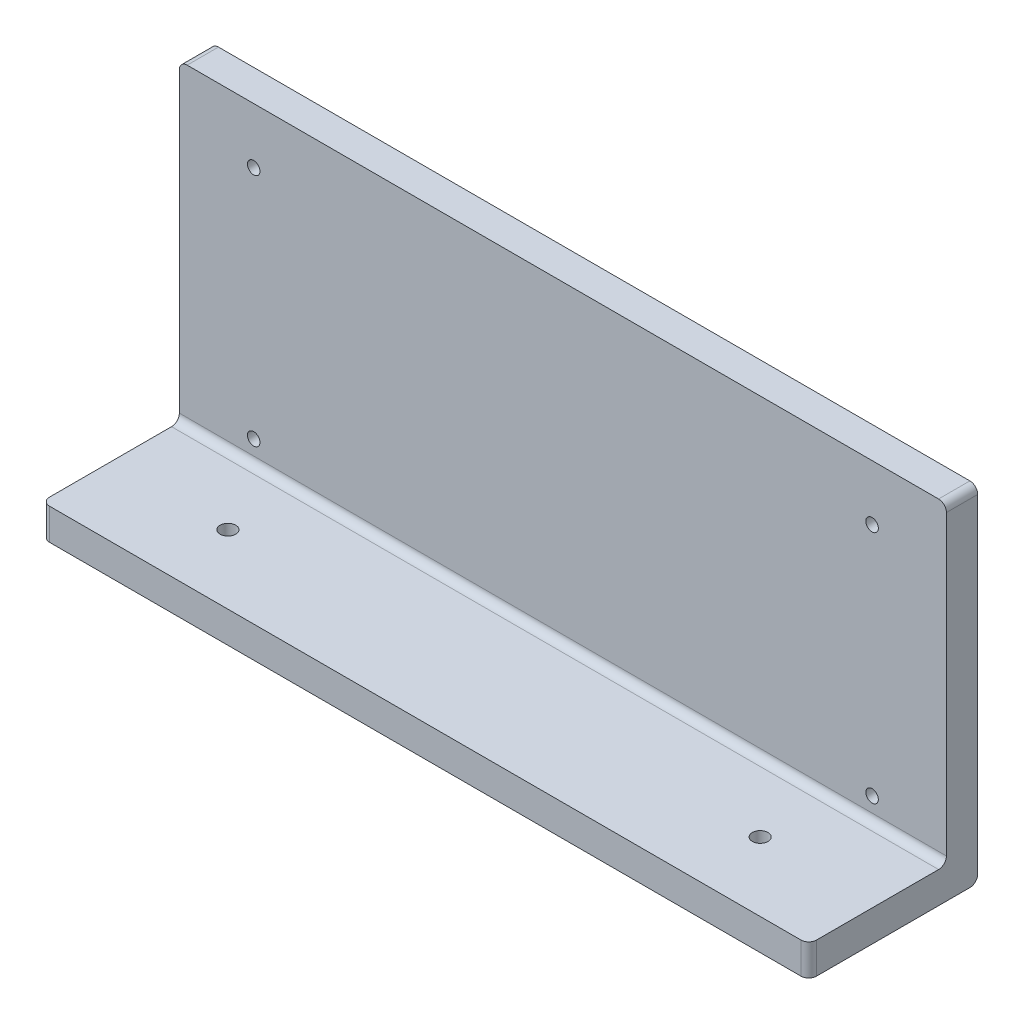
ISO-10303-21;
HEADER;
FILE_DESCRIPTION(('STEP AP214'),'2;1');
FILE_NAME('part.step','',(''),(''),'','','');
FILE_SCHEMA(('AUTOMOTIVE_DESIGN { 1 0 10303 214 1 1 1 1 }'));
ENDSEC;
DATA;
#1=APPLICATION_CONTEXT('core data for automotive mechanical design processes');
#2=APPLICATION_PROTOCOL_DEFINITION('international standard','automotive_design',2000,#1);
#3=PRODUCT_CONTEXT('',#1,'mechanical');
#4=PRODUCT('Part','Part','',(#3));
#5=PRODUCT_RELATED_PRODUCT_CATEGORY('part','',(#4));
#6=PRODUCT_DEFINITION_FORMATION('','',#4);
#7=PRODUCT_DEFINITION_CONTEXT('part definition',#1,'design');
#8=PRODUCT_DEFINITION('design','',#6,#7);
#9=PRODUCT_DEFINITION_SHAPE('','',#8);
#10=(LENGTH_UNIT() NAMED_UNIT(*) SI_UNIT(.MILLI.,.METRE.));
#11=(NAMED_UNIT(*) PLANE_ANGLE_UNIT() SI_UNIT($,.RADIAN.));
#12=(NAMED_UNIT(*) SI_UNIT($,.STERADIAN.) SOLID_ANGLE_UNIT());
#13=UNCERTAINTY_MEASURE_WITH_UNIT(LENGTH_MEASURE(1.E-05),#10,'distance_accuracy_value','');
#14=(GEOMETRIC_REPRESENTATION_CONTEXT(3) GLOBAL_UNCERTAINTY_ASSIGNED_CONTEXT((#13)) GLOBAL_UNIT_ASSIGNED_CONTEXT((#10,
#11,#12)) REPRESENTATION_CONTEXT('',''));
#15=CARTESIAN_POINT('',(0.,0.,0.));
#16=DIRECTION('',(0.,0.,1.));
#17=DIRECTION('',(1.,0.,0.));
#18=AXIS2_PLACEMENT_3D('',#15,#16,#17);
#19=CARTESIAN_POINT('',(0.,4.,0.));
#20=DIRECTION('',(0.,-1.,0.));
#21=DIRECTION('',(0.,0.,-1.));
#22=AXIS2_PLACEMENT_3D('',#19,#20,#21);
#23=PLANE('',#22);
#24=CARTESIAN_POINT('',(-34.,4.,2.));
#25=DIRECTION('',(0.,1.,0.));
#26=DIRECTION('',(0.,0.,1.));
#27=AXIS2_PLACEMENT_3D('',#24,#25,#26);
#28=CIRCLE('',#27,0.999999999999998);
#29=CARTESIAN_POINT('',(-34.,4.,3.));
#30=VERTEX_POINT('',#29);
#31=EDGE_CURVE('E270',#30,#30,#28,.T.);
#32=ORIENTED_EDGE('',*,*,#31,.F.);
#33=EDGE_LOOP('',(#32));
#34=FACE_BOUND('',#33,.T.);
#35=CARTESIAN_POINT('',(34.,4.,2.));
#36=DIRECTION('',(0.,1.,0.));
#37=DIRECTION('',(0.,0.,-1.));
#38=AXIS2_PLACEMENT_3D('',#35,#36,#37);
#39=CIRCLE('',#38,0.999999999999998);
#40=CARTESIAN_POINT('',(34.,4.,1.));
#41=VERTEX_POINT('',#40);
#42=EDGE_CURVE('E278',#41,#41,#39,.T.);
#43=ORIENTED_EDGE('',*,*,#42,.F.);
#44=EDGE_LOOP('',(#43));
#45=FACE_BOUND('',#44,.T.);
#46=DIRECTION('',(1.,0.,0.));
#47=VECTOR('',#46,1.);
#48=CARTESIAN_POINT('',(-49.,4.,10.795));
#49=LINE('',#48,#47);
#50=CARTESIAN_POINT('',(-48.,4.,10.795));
#51=VERTEX_POINT('',#50);
#52=CARTESIAN_POINT('',(48.,4.,10.795));
#53=VERTEX_POINT('',#52);
#54=EDGE_CURVE('E190',#51,#53,#49,.T.);
#55=ORIENTED_EDGE('',*,*,#54,.T.);
#56=CARTESIAN_POINT('',(48.,4.,9.795));
#57=DIRECTION('',(0.,-1.,0.));
#58=DIRECTION('',(0.,0.,-1.));
#59=AXIS2_PLACEMENT_3D('',#56,#57,#58);
#60=CIRCLE('',#59,1.);
#61=CARTESIAN_POINT('',(49.,4.,9.795));
#62=VERTEX_POINT('',#61);
#63=EDGE_CURVE('E263',#53,#62,#60,.F.);
#64=ORIENTED_EDGE('',*,*,#63,.T.);
#65=DIRECTION('',(0.,0.,-1.));
#66=VECTOR('',#65,1.);
#67=CARTESIAN_POINT('',(49.,4.,10.795));
#68=LINE('',#67,#66);
#69=CARTESIAN_POINT('',(49.,4.,-5.795));
#70=VERTEX_POINT('',#69);
#71=EDGE_CURVE('E182',#62,#70,#68,.T.);
#72=ORIENTED_EDGE('',*,*,#71,.T.);
#73=DIRECTION('',(1.,0.,0.));
#74=VECTOR('',#73,1.);
#75=CARTESIAN_POINT('',(-49.,4.,-5.79499999999999));
#76=LINE('',#75,#74);
#77=CARTESIAN_POINT('',(-49.,4.,-5.79499999999999));
#78=VERTEX_POINT('',#77);
#79=EDGE_CURVE('E258',#70,#78,#76,.F.);
#80=ORIENTED_EDGE('',*,*,#79,.T.);
#81=DIRECTION('',(0.,0.,1.));
#82=VECTOR('',#81,1.);
#83=CARTESIAN_POINT('',(-49.,4.,10.795));
#84=LINE('',#83,#82);
#85=CARTESIAN_POINT('',(-49.,4.,9.795));
#86=VERTEX_POINT('',#85);
#87=EDGE_CURVE('E186',#78,#86,#84,.T.);
#88=ORIENTED_EDGE('',*,*,#87,.T.);
#89=CARTESIAN_POINT('',(-48.,4.,9.795));
#90=DIRECTION('',(0.,-1.,0.));
#91=DIRECTION('',(0.,0.,-1.));
#92=AXIS2_PLACEMENT_3D('',#89,#90,#91);
#93=CIRCLE('',#92,1.);
#94=EDGE_CURVE('E64',#86,#51,#93,.F.);
#95=ORIENTED_EDGE('',*,*,#94,.T.);
#96=EDGE_LOOP('',(#55,#64,#72,#80,#88,#95));
#97=FACE_BOUND('',#96,.T.);
#98=ADVANCED_FACE('F39',(#34,#45,#97),#23,.F.);
#99=CARTESIAN_POINT('',(49.,4.,10.795));
#100=DIRECTION('',(-1.,0.,0.));
#101=DIRECTION('',(0.,0.,1.));
#102=AXIS2_PLACEMENT_3D('',#99,#100,#101);
#103=PLANE('',#102);
#104=DIRECTION('',(0.,-1.,0.));
#105=VECTOR('',#104,1.);
#106=CARTESIAN_POINT('',(49.,4.,-10.795));
#107=LINE('',#106,#105);
#108=CARTESIAN_POINT('',(49.,43.,-10.795));
#109=VERTEX_POINT('',#108);
#110=CARTESIAN_POINT('',(49.,1.,-10.795));
#111=VERTEX_POINT('',#110);
#112=EDGE_CURVE('E157',#109,#111,#107,.T.);
#113=ORIENTED_EDGE('',*,*,#112,.F.);
#114=DIRECTION('',(0.,0.,-1.));
#115=VECTOR('',#114,1.);
#116=CARTESIAN_POINT('',(49.,43.,10.795));
#117=LINE('',#116,#115);
#118=CARTESIAN_POINT('',(49.,43.,-6.795));
#119=VERTEX_POINT('',#118);
#120=EDGE_CURVE('E137',#109,#119,#117,.F.);
#121=ORIENTED_EDGE('',*,*,#120,.T.);
#122=DIRECTION('',(0.,-1.,0.));
#123=VECTOR('',#122,1.);
#124=CARTESIAN_POINT('',(49.,44.,-6.795));
#125=LINE('',#124,#123);
#126=CARTESIAN_POINT('',(49.,5.,-6.795));
#127=VERTEX_POINT('',#126);
#128=EDGE_CURVE('E167',#119,#127,#125,.T.);
#129=ORIENTED_EDGE('',*,*,#128,.T.);
#130=CARTESIAN_POINT('',(49.,5.,-5.795));
#131=DIRECTION('',(-1.,0.,0.));
#132=DIRECTION('',(0.,0.,1.));
#133=AXIS2_PLACEMENT_3D('',#130,#131,#132);
#134=CIRCLE('',#133,1.);
#135=EDGE_CURVE('E49',#127,#70,#134,.T.);
#136=ORIENTED_EDGE('',*,*,#135,.T.);
#137=ORIENTED_EDGE('',*,*,#71,.F.);
#138=DIRECTION('',(0.,-1.,0.));
#139=VECTOR('',#138,1.);
#140=CARTESIAN_POINT('',(49.,4.,9.795));
#141=LINE('',#140,#139);
#142=CARTESIAN_POINT('',(49.,0.,9.795));
#143=VERTEX_POINT('',#142);
#144=EDGE_CURVE('E237',#62,#143,#141,.T.);
#145=ORIENTED_EDGE('',*,*,#144,.T.);
#146=DIRECTION('',(0.,0.,-1.));
#147=VECTOR('',#146,1.);
#148=CARTESIAN_POINT('',(49.,0.,10.795));
#149=LINE('',#148,#147);
#150=CARTESIAN_POINT('',(49.,0.,-9.795));
#151=VERTEX_POINT('',#150);
#152=EDGE_CURVE('E181',#143,#151,#149,.T.);
#153=ORIENTED_EDGE('',*,*,#152,.T.);
#154=CARTESIAN_POINT('',(49.,1.,-9.795));
#155=DIRECTION('',(-1.,0.,0.));
#156=DIRECTION('',(0.,0.,1.));
#157=AXIS2_PLACEMENT_3D('',#154,#155,#156);
#158=CIRCLE('',#157,1.);
#159=EDGE_CURVE('E234',#151,#111,#158,.F.);
#160=ORIENTED_EDGE('',*,*,#159,.T.);
#161=EDGE_LOOP('',(#113,#121,#129,#136,#137,#145,#153,#160));
#162=FACE_BOUND('',#161,.T.);
#163=ADVANCED_FACE('F331',(#162),#103,.F.);
#164=CARTESIAN_POINT('',(-49.,4.,-10.795));
#165=DIRECTION('',(0.,0.,1.));
#166=DIRECTION('',(1.,0.,0.));
#167=AXIS2_PLACEMENT_3D('',#164,#165,#166);
#168=PLANE('',#167);
#169=CARTESIAN_POINT('',(39.5000000000002,6.90405139141699,-10.795));
#170=DIRECTION('',(0.,0.,1.));
#171=DIRECTION('',(1.,0.,0.));
#172=AXIS2_PLACEMENT_3D('',#169,#170,#171);
#173=CIRCLE('',#172,0.799999999999985);
#174=CARTESIAN_POINT('',(40.3000000000002,6.90405139141699,-10.795));
#175=VERTEX_POINT('',#174);
#176=EDGE_CURVE('E163',#175,#175,#173,.T.);
#177=ORIENTED_EDGE('',*,*,#176,.T.);
#178=EDGE_LOOP('',(#177));
#179=FACE_BOUND('',#178,.T.);
#180=CARTESIAN_POINT('',(39.4999999999999,36.904051391417,-10.795));
#181=DIRECTION('',(0.,0.,1.));
#182=DIRECTION('',(1.,0.,0.));
#183=AXIS2_PLACEMENT_3D('',#180,#181,#182);
#184=CIRCLE('',#183,0.799999999999985);
#185=CARTESIAN_POINT('',(40.2999999999999,36.904051391417,-10.795));
#186=VERTEX_POINT('',#185);
#187=EDGE_CURVE('E170',#186,#186,#184,.T.);
#188=ORIENTED_EDGE('',*,*,#187,.T.);
#189=EDGE_LOOP('',(#188));
#190=FACE_BOUND('',#189,.T.);
#191=CARTESIAN_POINT('',(-39.5000000000002,36.9040513914162,-10.795));
#192=DIRECTION('',(0.,0.,1.));
#193=DIRECTION('',(1.,0.,0.));
#194=AXIS2_PLACEMENT_3D('',#191,#192,#193);
#195=CIRCLE('',#194,0.800000000000016);
#196=CARTESIAN_POINT('',(-38.7000000000002,36.9040513914162,-10.795));
#197=VERTEX_POINT('',#196);
#198=EDGE_CURVE('E305',#197,#197,#195,.T.);
#199=ORIENTED_EDGE('',*,*,#198,.T.);
#200=EDGE_LOOP('',(#199));
#201=FACE_BOUND('',#200,.T.);
#202=CARTESIAN_POINT('',(-39.4999999999999,6.90405139141616,-10.795));
#203=DIRECTION('',(0.,0.,1.));
#204=DIRECTION('',(1.,0.,0.));
#205=AXIS2_PLACEMENT_3D('',#202,#203,#204);
#206=CIRCLE('',#205,0.799999999999983);
#207=CARTESIAN_POINT('',(-38.6999999999999,6.90405139141616,-10.795));
#208=VERTEX_POINT('',#207);
#209=EDGE_CURVE('E301',#208,#208,#206,.T.);
#210=ORIENTED_EDGE('',*,*,#209,.T.);
#211=EDGE_LOOP('',(#210));
#212=FACE_BOUND('',#211,.T.);
#213=DIRECTION('',(0.,-1.,0.));
#214=VECTOR('',#213,1.);
#215=CARTESIAN_POINT('',(-49.,4.,-10.795));
#216=LINE('',#215,#214);
#217=CARTESIAN_POINT('',(-49.,43.,-10.795));
#218=VERTEX_POINT('',#217);
#219=CARTESIAN_POINT('',(-49.,1.,-10.795));
#220=VERTEX_POINT('',#219);
#221=EDGE_CURVE('E193',#218,#220,#216,.T.);
#222=ORIENTED_EDGE('',*,*,#221,.F.);
#223=CARTESIAN_POINT('',(-48.,43.,-10.795));
#224=DIRECTION('',(0.,0.,1.));
#225=DIRECTION('',(1.,0.,0.));
#226=AXIS2_PLACEMENT_3D('',#223,#224,#225);
#227=CIRCLE('',#226,1.);
#228=CARTESIAN_POINT('',(-48.,44.,-10.795));
#229=VERTEX_POINT('',#228);
#230=EDGE_CURVE('E143',#218,#229,#227,.F.);
#231=ORIENTED_EDGE('',*,*,#230,.T.);
#232=DIRECTION('',(-1.,0.,0.));
#233=VECTOR('',#232,1.);
#234=CARTESIAN_POINT('',(49.,44.,-10.795));
#235=LINE('',#234,#233);
#236=CARTESIAN_POINT('',(48.,44.,-10.795));
#237=VERTEX_POINT('',#236);
#238=EDGE_CURVE('E151',#237,#229,#235,.T.);
#239=ORIENTED_EDGE('',*,*,#238,.F.);
#240=CARTESIAN_POINT('',(48.,43.,-10.795));
#241=DIRECTION('',(0.,0.,1.));
#242=DIRECTION('',(1.,0.,0.));
#243=AXIS2_PLACEMENT_3D('',#240,#241,#242);
#244=CIRCLE('',#243,1.);
#245=EDGE_CURVE('E132',#237,#109,#244,.F.);
#246=ORIENTED_EDGE('',*,*,#245,.T.);
#247=ORIENTED_EDGE('',*,*,#112,.T.);
#248=DIRECTION('',(-1.,0.,0.));
#249=VECTOR('',#248,1.);
#250=CARTESIAN_POINT('',(-49.,1.,-10.795));
#251=LINE('',#250,#249);
#252=EDGE_CURVE('E144',#111,#220,#251,.T.);
#253=ORIENTED_EDGE('',*,*,#252,.T.);
#254=EDGE_LOOP('',(#222,#231,#239,#246,#247,#253));
#255=FACE_BOUND('',#254,.T.);
#256=ADVANCED_FACE('F160',(#179,#190,#201,#212,#255),#168,.F.);
#257=CARTESIAN_POINT('',(-49.,4.,10.795));
#258=DIRECTION('',(1.,0.,0.));
#259=DIRECTION('',(0.,0.,-1.));
#260=AXIS2_PLACEMENT_3D('',#257,#258,#259);
#261=PLANE('',#260);
#262=DIRECTION('',(0.,-1.,0.));
#263=VECTOR('',#262,1.);
#264=CARTESIAN_POINT('',(-49.,44.,-6.79499999999999));
#265=LINE('',#264,#263);
#266=CARTESIAN_POINT('',(-49.,43.,-6.79499999999999));
#267=VERTEX_POINT('',#266);
#268=CARTESIAN_POINT('',(-49.,5.,-6.79499999999999));
#269=VERTEX_POINT('',#268);
#270=EDGE_CURVE('E177',#267,#269,#265,.T.);
#271=ORIENTED_EDGE('',*,*,#270,.F.);
#272=DIRECTION('',(0.,0.,1.));
#273=VECTOR('',#272,1.);
#274=CARTESIAN_POINT('',(-49.,43.,10.795));
#275=LINE('',#274,#273);
#276=EDGE_CURVE('E226',#267,#218,#275,.F.);
#277=ORIENTED_EDGE('',*,*,#276,.T.);
#278=ORIENTED_EDGE('',*,*,#221,.T.);
#279=CARTESIAN_POINT('',(-49.,1.,-9.795));
#280=DIRECTION('',(1.,0.,0.));
#281=DIRECTION('',(0.,0.,-1.));
#282=AXIS2_PLACEMENT_3D('',#279,#280,#281);
#283=CIRCLE('',#282,1.);
#284=CARTESIAN_POINT('',(-49.,0.,-9.795));
#285=VERTEX_POINT('',#284);
#286=EDGE_CURVE('E220',#220,#285,#283,.F.);
#287=ORIENTED_EDGE('',*,*,#286,.T.);
#288=DIRECTION('',(0.,0.,1.));
#289=VECTOR('',#288,1.);
#290=CARTESIAN_POINT('',(-49.,0.,10.795));
#291=LINE('',#290,#289);
#292=CARTESIAN_POINT('',(-49.,0.,9.795));
#293=VERTEX_POINT('',#292);
#294=EDGE_CURVE('E197',#285,#293,#291,.T.);
#295=ORIENTED_EDGE('',*,*,#294,.T.);
#296=DIRECTION('',(0.,-1.,0.));
#297=VECTOR('',#296,1.);
#298=CARTESIAN_POINT('',(-49.,4.,9.795));
#299=LINE('',#298,#297);
#300=EDGE_CURVE('E223',#293,#86,#299,.F.);
#301=ORIENTED_EDGE('',*,*,#300,.T.);
#302=ORIENTED_EDGE('',*,*,#87,.F.);
#303=CARTESIAN_POINT('',(-49.,5.,-5.79499999999999));
#304=DIRECTION('',(1.,0.,0.));
#305=DIRECTION('',(0.,0.,-1.));
#306=AXIS2_PLACEMENT_3D('',#303,#304,#305);
#307=CIRCLE('',#306,1.);
#308=EDGE_CURVE('E11',#78,#269,#307,.T.);
#309=ORIENTED_EDGE('',*,*,#308,.T.);
#310=EDGE_LOOP('',(#271,#277,#278,#287,#295,#301,#302,#309));
#311=FACE_BOUND('',#310,.T.);
#312=ADVANCED_FACE('F351',(#311),#261,.F.);
#313=CARTESIAN_POINT('',(-49.,4.,10.795));
#314=DIRECTION('',(0.,0.,-1.));
#315=DIRECTION('',(-1.,0.,0.));
#316=AXIS2_PLACEMENT_3D('',#313,#314,#315);
#317=PLANE('',#316);
#318=DIRECTION('',(1.,0.,0.));
#319=VECTOR('',#318,1.);
#320=CARTESIAN_POINT('',(-49.,0.,10.795));
#321=LINE('',#320,#319);
#322=CARTESIAN_POINT('',(-48.,0.,10.795));
#323=VERTEX_POINT('',#322);
#324=CARTESIAN_POINT('',(48.,0.,10.795));
#325=VERTEX_POINT('',#324);
#326=EDGE_CURVE('E187',#323,#325,#321,.T.);
#327=ORIENTED_EDGE('',*,*,#326,.T.);
#328=DIRECTION('',(0.,-1.,0.));
#329=VECTOR('',#328,1.);
#330=CARTESIAN_POINT('',(48.,4.,10.795));
#331=LINE('',#330,#329);
#332=EDGE_CURVE('E57',#325,#53,#331,.F.);
#333=ORIENTED_EDGE('',*,*,#332,.T.);
#334=ORIENTED_EDGE('',*,*,#54,.F.);
#335=DIRECTION('',(0.,-1.,0.));
#336=VECTOR('',#335,1.);
#337=CARTESIAN_POINT('',(-48.,4.,10.795));
#338=LINE('',#337,#336);
#339=EDGE_CURVE('E252',#51,#323,#338,.T.);
#340=ORIENTED_EDGE('',*,*,#339,.T.);
#341=EDGE_LOOP('',(#327,#333,#334,#340));
#342=FACE_BOUND('',#341,.T.);
#343=ADVANCED_FACE('F347',(#342),#317,.F.);
#344=CARTESIAN_POINT('',(0.,0.,0.));
#345=DIRECTION('',(0.,-1.,0.));
#346=DIRECTION('',(0.,0.,-1.));
#347=AXIS2_PLACEMENT_3D('',#344,#345,#346);
#348=PLANE('',#347);
#349=CARTESIAN_POINT('',(-34.,0.,2.));
#350=DIRECTION('',(0.,-1.,0.));
#351=DIRECTION('',(0.,0.,-1.));
#352=AXIS2_PLACEMENT_3D('',#349,#350,#351);
#353=CIRCLE('',#352,0.999999999999998);
#354=CARTESIAN_POINT('',(-34.,0.,1.));
#355=VERTEX_POINT('',#354);
#356=EDGE_CURVE('E43',#355,#355,#353,.T.);
#357=ORIENTED_EDGE('',*,*,#356,.F.);
#358=EDGE_LOOP('',(#357));
#359=FACE_BOUND('',#358,.T.);
#360=CARTESIAN_POINT('',(34.,0.,2.));
#361=DIRECTION('',(0.,-1.,0.));
#362=DIRECTION('',(0.,0.,-1.));
#363=AXIS2_PLACEMENT_3D('',#360,#361,#362);
#364=CIRCLE('',#363,0.999999999999998);
#365=CARTESIAN_POINT('',(34.,0.,1.));
#366=VERTEX_POINT('',#365);
#367=EDGE_CURVE('E267',#366,#366,#364,.T.);
#368=ORIENTED_EDGE('',*,*,#367,.F.);
#369=EDGE_LOOP('',(#368));
#370=FACE_BOUND('',#369,.T.);
#371=ORIENTED_EDGE('',*,*,#152,.F.);
#372=CARTESIAN_POINT('',(48.,0.,9.795));
#373=DIRECTION('',(0.,-1.,0.));
#374=DIRECTION('',(0.,0.,-1.));
#375=AXIS2_PLACEMENT_3D('',#372,#373,#374);
#376=CIRCLE('',#375,1.);
#377=EDGE_CURVE('E249',#143,#325,#376,.T.);
#378=ORIENTED_EDGE('',*,*,#377,.T.);
#379=ORIENTED_EDGE('',*,*,#326,.F.);
#380=CARTESIAN_POINT('',(-48.,0.,9.795));
#381=DIRECTION('',(0.,-1.,0.));
#382=DIRECTION('',(0.,0.,-1.));
#383=AXIS2_PLACEMENT_3D('',#380,#381,#382);
#384=CIRCLE('',#383,1.);
#385=EDGE_CURVE('E246',#323,#293,#384,.T.);
#386=ORIENTED_EDGE('',*,*,#385,.T.);
#387=ORIENTED_EDGE('',*,*,#294,.F.);
#388=DIRECTION('',(-1.,0.,0.));
#389=VECTOR('',#388,1.);
#390=CARTESIAN_POINT('',(49.,0.,-9.795));
#391=LINE('',#390,#389);
#392=EDGE_CURVE('E243',#285,#151,#391,.F.);
#393=ORIENTED_EDGE('',*,*,#392,.T.);
#394=EDGE_LOOP('',(#371,#378,#379,#386,#387,#393));
#395=FACE_BOUND('',#394,.T.);
#396=ADVANCED_FACE('F344',(#359,#370,#395),#348,.T.);
#397=CARTESIAN_POINT('',(49.,44.,-6.795));
#398=DIRECTION('',(0.,0.,-1.));
#399=DIRECTION('',(-1.,0.,0.));
#400=AXIS2_PLACEMENT_3D('',#397,#398,#399);
#401=PLANE('',#400);
#402=CARTESIAN_POINT('',(39.5000000000002,6.90405139141699,-6.79499999999999));
#403=DIRECTION('',(0.,0.,1.));
#404=DIRECTION('',(1.,0.,0.));
#405=AXIS2_PLACEMENT_3D('',#402,#403,#404);
#406=CIRCLE('',#405,0.799999999999985);
#407=CARTESIAN_POINT('',(40.3000000000002,6.90405139141699,-6.79499999999999));
#408=VERTEX_POINT('',#407);
#409=EDGE_CURVE('E276',#408,#408,#406,.T.);
#410=ORIENTED_EDGE('',*,*,#409,.F.);
#411=EDGE_LOOP('',(#410));
#412=FACE_BOUND('',#411,.T.);
#413=CARTESIAN_POINT('',(39.4999999999999,36.904051391417,-6.79499999999999));
#414=DIRECTION('',(0.,0.,1.));
#415=DIRECTION('',(1.,0.,0.));
#416=AXIS2_PLACEMENT_3D('',#413,#414,#415);
#417=CIRCLE('',#416,0.799999999999985);
#418=CARTESIAN_POINT('',(40.2999999999999,36.904051391417,-6.79499999999999));
#419=VERTEX_POINT('',#418);
#420=EDGE_CURVE('E291',#419,#419,#417,.T.);
#421=ORIENTED_EDGE('',*,*,#420,.F.);
#422=EDGE_LOOP('',(#421));
#423=FACE_BOUND('',#422,.T.);
#424=CARTESIAN_POINT('',(-39.5000000000002,36.9040513914162,-6.79499999999999));
#425=DIRECTION('',(0.,0.,1.));
#426=DIRECTION('',(1.,0.,0.));
#427=AXIS2_PLACEMENT_3D('',#424,#425,#426);
#428=CIRCLE('',#427,0.800000000000016);
#429=CARTESIAN_POINT('',(-38.7000000000002,36.9040513914162,-6.79499999999999));
#430=VERTEX_POINT('',#429);
#431=EDGE_CURVE('E286',#430,#430,#428,.T.);
#432=ORIENTED_EDGE('',*,*,#431,.F.);
#433=EDGE_LOOP('',(#432));
#434=FACE_BOUND('',#433,.T.);
#435=CARTESIAN_POINT('',(-39.4999999999999,6.90405139141616,-6.79499999999999));
#436=DIRECTION('',(0.,0.,1.));
#437=DIRECTION('',(1.,0.,0.));
#438=AXIS2_PLACEMENT_3D('',#435,#436,#437);
#439=CIRCLE('',#438,0.799999999999983);
#440=CARTESIAN_POINT('',(-38.6999999999999,6.90405139141616,-6.79499999999999));
#441=VERTEX_POINT('',#440);
#442=EDGE_CURVE('E290',#441,#441,#439,.T.);
#443=ORIENTED_EDGE('',*,*,#442,.F.);
#444=EDGE_LOOP('',(#443));
#445=FACE_BOUND('',#444,.T.);
#446=DIRECTION('',(1.,0.,0.));
#447=VECTOR('',#446,1.);
#448=CARTESIAN_POINT('',(49.,44.,-6.795));
#449=LINE('',#448,#447);
#450=CARTESIAN_POINT('',(-48.,44.,-6.79499999999999));
#451=VERTEX_POINT('',#450);
#452=CARTESIAN_POINT('',(48.,44.,-6.795));
#453=VERTEX_POINT('',#452);
#454=EDGE_CURVE('E154',#451,#453,#449,.T.);
#455=ORIENTED_EDGE('',*,*,#454,.F.);
#456=CARTESIAN_POINT('',(-48.,43.,-6.79499999999999));
#457=DIRECTION('',(0.,0.,-1.));
#458=DIRECTION('',(-1.,0.,0.));
#459=AXIS2_PLACEMENT_3D('',#456,#457,#458);
#460=CIRCLE('',#459,1.);
#461=EDGE_CURVE('E217',#451,#267,#460,.F.);
#462=ORIENTED_EDGE('',*,*,#461,.T.);
#463=ORIENTED_EDGE('',*,*,#270,.T.);
#464=DIRECTION('',(1.,0.,0.));
#465=VECTOR('',#464,1.);
#466=CARTESIAN_POINT('',(49.,5.,-6.795));
#467=LINE('',#466,#465);
#468=EDGE_CURVE('E210',#269,#127,#467,.T.);
#469=ORIENTED_EDGE('',*,*,#468,.T.);
#470=ORIENTED_EDGE('',*,*,#128,.F.);
#471=CARTESIAN_POINT('',(48.,43.,-6.795));
#472=DIRECTION('',(0.,0.,-1.));
#473=DIRECTION('',(-1.,0.,0.));
#474=AXIS2_PLACEMENT_3D('',#471,#472,#473);
#475=CIRCLE('',#474,1.);
#476=EDGE_CURVE('E214',#119,#453,#475,.F.);
#477=ORIENTED_EDGE('',*,*,#476,.T.);
#478=EDGE_LOOP('',(#455,#462,#463,#469,#470,#477));
#479=FACE_BOUND('',#478,.T.);
#480=ADVANCED_FACE('F342',(#412,#423,#434,#445,#479),#401,.F.);
#481=CARTESIAN_POINT('',(0.,44.,0.));
#482=DIRECTION('',(0.,-1.,0.));
#483=DIRECTION('',(0.,0.,-1.));
#484=AXIS2_PLACEMENT_3D('',#481,#482,#483);
#485=PLANE('',#484);
#486=ORIENTED_EDGE('',*,*,#238,.T.);
#487=DIRECTION('',(0.,0.,1.));
#488=VECTOR('',#487,1.);
#489=CARTESIAN_POINT('',(-48.,44.,0.));
#490=LINE('',#489,#488);
#491=EDGE_CURVE('E156',#229,#451,#490,.T.);
#492=ORIENTED_EDGE('',*,*,#491,.T.);
#493=ORIENTED_EDGE('',*,*,#454,.T.);
#494=DIRECTION('',(0.,0.,-1.));
#495=VECTOR('',#494,1.);
#496=CARTESIAN_POINT('',(48.,44.,0.));
#497=LINE('',#496,#495);
#498=EDGE_CURVE('E136',#453,#237,#497,.T.);
#499=ORIENTED_EDGE('',*,*,#498,.T.);
#500=EDGE_LOOP('',(#486,#492,#493,#499));
#501=FACE_BOUND('',#500,.T.);
#502=ADVANCED_FACE('F149',(#501),#485,.F.);
#503=CARTESIAN_POINT('',(-39.4999999999999,6.90405139141616,-27.795));
#504=DIRECTION('',(0.,0.,1.));
#505=DIRECTION('',(1.,0.,0.));
#506=AXIS2_PLACEMENT_3D('',#503,#504,#505);
#507=CYLINDRICAL_SURFACE('',#506,0.799999999999983);
#508=ORIENTED_EDGE('',*,*,#442,.T.);
#509=EDGE_LOOP('',(#508));
#510=FACE_BOUND('',#509,.T.);
#511=ORIENTED_EDGE('',*,*,#209,.F.);
#512=EDGE_LOOP('',(#511));
#513=FACE_BOUND('',#512,.T.);
#514=ADVANCED_FACE('F327',(#510,#513),#507,.F.);
#515=CARTESIAN_POINT('',(-39.5000000000002,36.9040513914162,-27.795));
#516=DIRECTION('',(0.,0.,1.));
#517=DIRECTION('',(1.,0.,0.));
#518=AXIS2_PLACEMENT_3D('',#515,#516,#517);
#519=CYLINDRICAL_SURFACE('',#518,0.800000000000016);
#520=ORIENTED_EDGE('',*,*,#431,.T.);
#521=EDGE_LOOP('',(#520));
#522=FACE_BOUND('',#521,.T.);
#523=ORIENTED_EDGE('',*,*,#198,.F.);
#524=EDGE_LOOP('',(#523));
#525=FACE_BOUND('',#524,.T.);
#526=ADVANCED_FACE('F317',(#522,#525),#519,.F.);
#527=CARTESIAN_POINT('',(39.4999999999999,36.904051391417,-27.795));
#528=DIRECTION('',(0.,0.,1.));
#529=DIRECTION('',(1.,0.,0.));
#530=AXIS2_PLACEMENT_3D('',#527,#528,#529);
#531=CYLINDRICAL_SURFACE('',#530,0.799999999999985);
#532=ORIENTED_EDGE('',*,*,#420,.T.);
#533=EDGE_LOOP('',(#532));
#534=FACE_BOUND('',#533,.T.);
#535=ORIENTED_EDGE('',*,*,#187,.F.);
#536=EDGE_LOOP('',(#535));
#537=FACE_BOUND('',#536,.T.);
#538=ADVANCED_FACE('F314',(#534,#537),#531,.F.);
#539=CARTESIAN_POINT('',(39.5000000000002,6.90405139141699,-27.795));
#540=DIRECTION('',(0.,0.,1.));
#541=DIRECTION('',(1.,0.,0.));
#542=AXIS2_PLACEMENT_3D('',#539,#540,#541);
#543=CYLINDRICAL_SURFACE('',#542,0.799999999999985);
#544=ORIENTED_EDGE('',*,*,#409,.T.);
#545=EDGE_LOOP('',(#544));
#546=FACE_BOUND('',#545,.T.);
#547=ORIENTED_EDGE('',*,*,#176,.F.);
#548=EDGE_LOOP('',(#547));
#549=FACE_BOUND('',#548,.T.);
#550=ADVANCED_FACE('F316',(#546,#549),#543,.F.);
#551=CARTESIAN_POINT('',(-48.,43.,0.));
#552=DIRECTION('',(0.,0.,1.));
#553=DIRECTION('',(1.,0.,0.));
#554=AXIS2_PLACEMENT_3D('',#551,#552,#553);
#555=CYLINDRICAL_SURFACE('',#554,1.);
#556=ORIENTED_EDGE('',*,*,#230,.F.);
#557=ORIENTED_EDGE('',*,*,#276,.F.);
#558=ORIENTED_EDGE('',*,*,#461,.F.);
#559=ORIENTED_EDGE('',*,*,#491,.F.);
#560=EDGE_LOOP('',(#556,#557,#558,#559));
#561=FACE_BOUND('',#560,.T.);
#562=ADVANCED_FACE('F324',(#561),#555,.T.);
#563=CARTESIAN_POINT('',(48.,43.,0.));
#564=DIRECTION('',(0.,0.,-1.));
#565=DIRECTION('',(-1.,0.,0.));
#566=AXIS2_PLACEMENT_3D('',#563,#564,#565);
#567=CYLINDRICAL_SURFACE('',#566,1.);
#568=ORIENTED_EDGE('',*,*,#476,.F.);
#569=ORIENTED_EDGE('',*,*,#120,.F.);
#570=ORIENTED_EDGE('',*,*,#245,.F.);
#571=ORIENTED_EDGE('',*,*,#498,.F.);
#572=EDGE_LOOP('',(#568,#569,#570,#571));
#573=FACE_BOUND('',#572,.T.);
#574=ADVANCED_FACE('F135',(#573),#567,.T.);
#575=CARTESIAN_POINT('',(48.,4.,9.795));
#576=DIRECTION('',(0.,-1.,0.));
#577=DIRECTION('',(0.,0.,-1.));
#578=AXIS2_PLACEMENT_3D('',#575,#576,#577);
#579=CYLINDRICAL_SURFACE('',#578,1.);
#580=ORIENTED_EDGE('',*,*,#63,.F.);
#581=ORIENTED_EDGE('',*,*,#332,.F.);
#582=ORIENTED_EDGE('',*,*,#377,.F.);
#583=ORIENTED_EDGE('',*,*,#144,.F.);
#584=EDGE_LOOP('',(#580,#581,#582,#583));
#585=FACE_BOUND('',#584,.T.);
#586=ADVANCED_FACE('F363',(#585),#579,.T.);
#587=CARTESIAN_POINT('',(-48.,4.,9.795));
#588=DIRECTION('',(0.,-1.,0.));
#589=DIRECTION('',(0.,0.,-1.));
#590=AXIS2_PLACEMENT_3D('',#587,#588,#589);
#591=CYLINDRICAL_SURFACE('',#590,1.);
#592=ORIENTED_EDGE('',*,*,#94,.F.);
#593=ORIENTED_EDGE('',*,*,#300,.F.);
#594=ORIENTED_EDGE('',*,*,#385,.F.);
#595=ORIENTED_EDGE('',*,*,#339,.F.);
#596=EDGE_LOOP('',(#592,#593,#594,#595));
#597=FACE_BOUND('',#596,.T.);
#598=ADVANCED_FACE('F366',(#597),#591,.T.);
#599=CARTESIAN_POINT('',(-49.,1.,-9.795));
#600=DIRECTION('',(1.,0.,0.));
#601=DIRECTION('',(0.,0.,-1.));
#602=AXIS2_PLACEMENT_3D('',#599,#600,#601);
#603=CYLINDRICAL_SURFACE('',#602,1.);
#604=ORIENTED_EDGE('',*,*,#159,.F.);
#605=ORIENTED_EDGE('',*,*,#392,.F.);
#606=ORIENTED_EDGE('',*,*,#286,.F.);
#607=ORIENTED_EDGE('',*,*,#252,.F.);
#608=EDGE_LOOP('',(#604,#605,#606,#607));
#609=FACE_BOUND('',#608,.T.);
#610=ADVANCED_FACE('F369',(#609),#603,.T.);
#611=CARTESIAN_POINT('',(49.,5.,-5.795));
#612=DIRECTION('',(-1.,0.,0.));
#613=DIRECTION('',(0.,0.,1.));
#614=AXIS2_PLACEMENT_3D('',#611,#612,#613);
#615=CYLINDRICAL_SURFACE('',#614,1.);
#616=ORIENTED_EDGE('',*,*,#308,.F.);
#617=ORIENTED_EDGE('',*,*,#79,.F.);
#618=ORIENTED_EDGE('',*,*,#135,.F.);
#619=ORIENTED_EDGE('',*,*,#468,.F.);
#620=EDGE_LOOP('',(#616,#617,#618,#619));
#621=FACE_BOUND('',#620,.T.);
#622=ADVANCED_FACE('F41',(#621),#615,.F.);
#623=CARTESIAN_POINT('',(34.,-17.,2.));
#624=DIRECTION('',(0.,1.,0.));
#625=DIRECTION('',(0.,0.,1.));
#626=AXIS2_PLACEMENT_3D('',#623,#624,#625);
#627=CYLINDRICAL_SURFACE('',#626,0.999999999999998);
#628=ORIENTED_EDGE('',*,*,#367,.T.);
#629=EDGE_LOOP('',(#628));
#630=FACE_BOUND('',#629,.T.);
#631=ORIENTED_EDGE('',*,*,#42,.T.);
#632=EDGE_LOOP('',(#631));
#633=FACE_BOUND('',#632,.T.);
#634=ADVANCED_FACE('F376',(#630,#633),#627,.F.);
#635=CARTESIAN_POINT('',(-34.,-17.,2.));
#636=DIRECTION('',(0.,1.,0.));
#637=DIRECTION('',(0.,0.,1.));
#638=AXIS2_PLACEMENT_3D('',#635,#636,#637);
#639=CYLINDRICAL_SURFACE('',#638,0.999999999999998);
#640=ORIENTED_EDGE('',*,*,#356,.T.);
#641=EDGE_LOOP('',(#640));
#642=FACE_BOUND('',#641,.T.);
#643=ORIENTED_EDGE('',*,*,#31,.T.);
#644=EDGE_LOOP('',(#643));
#645=FACE_BOUND('',#644,.T.);
#646=ADVANCED_FACE('F522',(#642,#645),#639,.F.);
#647=CLOSED_SHELL('',(#98,#163,#256,#312,#343,#396,#480,#502,#514,#526,#538,#550,#562,#574,#586,
#598,#610,#622,#634,#646));
#648=MANIFOLD_SOLID_BREP('B2',#647);
#649=ADVANCED_BREP_SHAPE_REPRESENTATION('',(#18,#648),#14);
#650=SHAPE_DEFINITION_REPRESENTATION(#9,#649);
ENDSEC;
END-ISO-10303-21;
